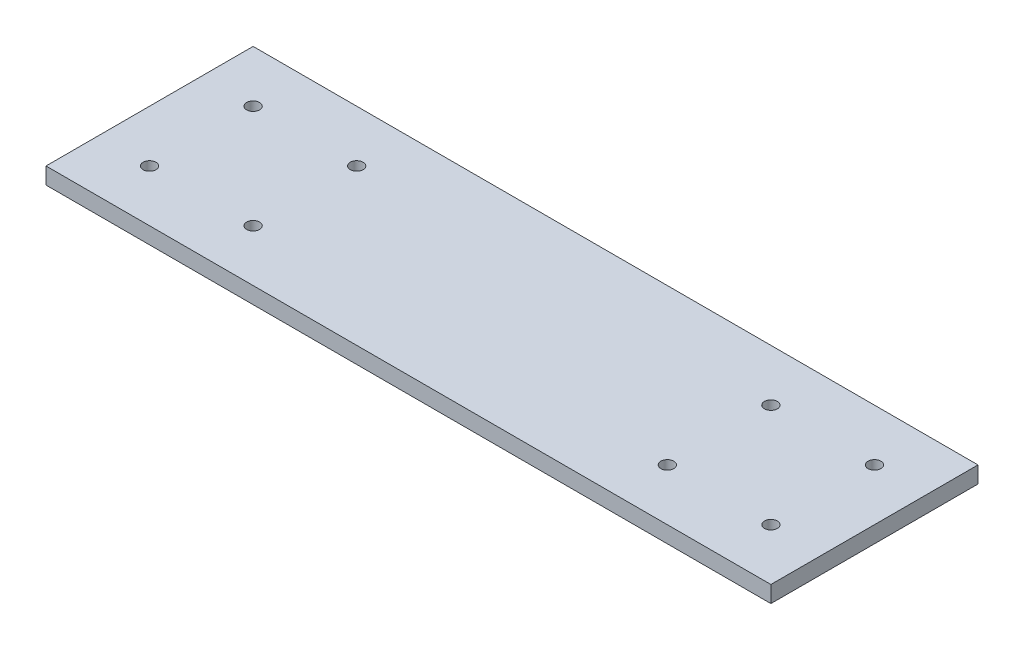
ISO-10303-21;
HEADER;
FILE_DESCRIPTION(('STEP AP214'),'2;1');
FILE_NAME('part.step','',(''),(''),'','','');
FILE_SCHEMA(('AUTOMOTIVE_DESIGN { 1 0 10303 214 1 1 1 1 }'));
ENDSEC;
DATA;
#1=APPLICATION_CONTEXT('core data for automotive mechanical design processes');
#2=APPLICATION_PROTOCOL_DEFINITION('international standard','automotive_design',2000,#1);
#3=PRODUCT_CONTEXT('',#1,'mechanical');
#4=PRODUCT('Part','Part','',(#3));
#5=PRODUCT_RELATED_PRODUCT_CATEGORY('part','',(#4));
#6=PRODUCT_DEFINITION_FORMATION('','',#4);
#7=PRODUCT_DEFINITION_CONTEXT('part definition',#1,'design');
#8=PRODUCT_DEFINITION('design','',#6,#7);
#9=PRODUCT_DEFINITION_SHAPE('','',#8);
#10=(LENGTH_UNIT() NAMED_UNIT(*) SI_UNIT(.MILLI.,.METRE.));
#11=(NAMED_UNIT(*) PLANE_ANGLE_UNIT() SI_UNIT($,.RADIAN.));
#12=(NAMED_UNIT(*) SI_UNIT($,.STERADIAN.) SOLID_ANGLE_UNIT());
#13=UNCERTAINTY_MEASURE_WITH_UNIT(LENGTH_MEASURE(1.E-05),#10,'distance_accuracy_value','');
#14=(GEOMETRIC_REPRESENTATION_CONTEXT(3) GLOBAL_UNCERTAINTY_ASSIGNED_CONTEXT((#13)) GLOBAL_UNIT_ASSIGNED_CONTEXT((#10,
#11,#12)) REPRESENTATION_CONTEXT('',''));
#15=CARTESIAN_POINT('',(0.,0.,0.));
#16=DIRECTION('',(0.,0.,1.));
#17=DIRECTION('',(1.,0.,0.));
#18=AXIS2_PLACEMENT_3D('',#15,#16,#17);
#19=CARTESIAN_POINT('',(0.,4.064,0.));
#20=DIRECTION('',(1.,0.,0.));
#21=DIRECTION('',(0.,0.,-1.));
#22=AXIS2_PLACEMENT_3D('',#19,#20,#21);
#23=PLANE('',#22);
#24=DIRECTION('',(0.,0.,1.));
#25=VECTOR('',#24,1.);
#26=CARTESIAN_POINT('',(0.,0.,0.));
#27=LINE('',#26,#25);
#28=CARTESIAN_POINT('',(0.,0.,-50.8));
#29=VERTEX_POINT('',#28);
#30=CARTESIAN_POINT('',(0.,0.,0.));
#31=VERTEX_POINT('',#30);
#32=EDGE_CURVE('E83',#29,#31,#27,.T.);
#33=ORIENTED_EDGE('',*,*,#32,.T.);
#34=DIRECTION('',(0.,-1.,0.));
#35=VECTOR('',#34,1.);
#36=CARTESIAN_POINT('',(0.,4.064,0.));
#37=LINE('',#36,#35);
#38=CARTESIAN_POINT('',(0.,4.064,0.));
#39=VERTEX_POINT('',#38);
#40=EDGE_CURVE('E11',#39,#31,#37,.T.);
#41=ORIENTED_EDGE('',*,*,#40,.F.);
#42=DIRECTION('',(0.,0.,1.));
#43=VECTOR('',#42,1.);
#44=CARTESIAN_POINT('',(0.,4.064,0.));
#45=LINE('',#44,#43);
#46=CARTESIAN_POINT('',(0.,4.064,-50.8));
#47=VERTEX_POINT('',#46);
#48=EDGE_CURVE('E77',#47,#39,#45,.T.);
#49=ORIENTED_EDGE('',*,*,#48,.F.);
#50=DIRECTION('',(0.,-1.,0.));
#51=VECTOR('',#50,1.);
#52=CARTESIAN_POINT('',(0.,4.064,-50.8));
#53=LINE('',#52,#51);
#54=EDGE_CURVE('E39',#47,#29,#53,.T.);
#55=ORIENTED_EDGE('',*,*,#54,.T.);
#56=EDGE_LOOP('',(#33,#41,#49,#55));
#57=FACE_BOUND('',#56,.T.);
#58=ADVANCED_FACE('F32',(#57),#23,.F.);
#59=CARTESIAN_POINT('',(0.,4.064,0.));
#60=DIRECTION('',(0.,0.,-1.));
#61=DIRECTION('',(-1.,0.,0.));
#62=AXIS2_PLACEMENT_3D('',#59,#60,#61);
#63=PLANE('',#62);
#64=DIRECTION('',(1.,0.,0.));
#65=VECTOR('',#64,1.);
#66=CARTESIAN_POINT('',(0.,0.,0.));
#67=LINE('',#66,#65);
#68=CARTESIAN_POINT('',(177.8,0.,0.));
#69=VERTEX_POINT('',#68);
#70=EDGE_CURVE('E78',#31,#69,#67,.T.);
#71=ORIENTED_EDGE('',*,*,#70,.T.);
#72=DIRECTION('',(0.,1.,0.));
#73=VECTOR('',#72,1.);
#74=CARTESIAN_POINT('',(177.8,0.,0.));
#75=LINE('',#74,#73);
#76=CARTESIAN_POINT('',(177.8,4.064,0.));
#77=VERTEX_POINT('',#76);
#78=EDGE_CURVE('E46',#69,#77,#75,.T.);
#79=ORIENTED_EDGE('',*,*,#78,.T.);
#80=DIRECTION('',(1.,0.,0.));
#81=VECTOR('',#80,1.);
#82=CARTESIAN_POINT('',(0.,4.064,0.));
#83=LINE('',#82,#81);
#84=EDGE_CURVE('E95',#39,#77,#83,.T.);
#85=ORIENTED_EDGE('',*,*,#84,.F.);
#86=ORIENTED_EDGE('',*,*,#40,.T.);
#87=EDGE_LOOP('',(#71,#79,#85,#86));
#88=FACE_BOUND('',#87,.T.);
#89=ADVANCED_FACE('F149',(#88),#63,.F.);
#90=CARTESIAN_POINT('',(0.,4.064,-50.8));
#91=DIRECTION('',(0.,0.,1.));
#92=DIRECTION('',(1.,0.,0.));
#93=AXIS2_PLACEMENT_3D('',#90,#91,#92);
#94=PLANE('',#93);
#95=DIRECTION('',(-1.,0.,0.));
#96=VECTOR('',#95,1.);
#97=CARTESIAN_POINT('',(0.,4.064,-50.8));
#98=LINE('',#97,#96);
#99=CARTESIAN_POINT('',(177.8,4.064,-50.8));
#100=VERTEX_POINT('',#99);
#101=EDGE_CURVE('E55',#100,#47,#98,.T.);
#102=ORIENTED_EDGE('',*,*,#101,.F.);
#103=DIRECTION('',(0.,1.,0.));
#104=VECTOR('',#103,1.);
#105=CARTESIAN_POINT('',(177.8,0.,-50.8));
#106=LINE('',#105,#104);
#107=CARTESIAN_POINT('',(177.8,0.,-50.8));
#108=VERTEX_POINT('',#107);
#109=EDGE_CURVE('E74',#108,#100,#106,.T.);
#110=ORIENTED_EDGE('',*,*,#109,.F.);
#111=DIRECTION('',(-1.,0.,0.));
#112=VECTOR('',#111,1.);
#113=CARTESIAN_POINT('',(0.,0.,-50.8));
#114=LINE('',#113,#112);
#115=EDGE_CURVE('E69',#108,#29,#114,.T.);
#116=ORIENTED_EDGE('',*,*,#115,.T.);
#117=ORIENTED_EDGE('',*,*,#54,.F.);
#118=EDGE_LOOP('',(#102,#110,#116,#117));
#119=FACE_BOUND('',#118,.T.);
#120=ADVANCED_FACE('F71',(#119),#94,.F.);
#121=CARTESIAN_POINT('',(0.,4.064,0.));
#122=DIRECTION('',(0.,-1.,0.));
#123=DIRECTION('',(0.,0.,-1.));
#124=AXIS2_PLACEMENT_3D('',#121,#122,#123);
#125=PLANE('',#124);
#126=CARTESIAN_POINT('',(12.7,4.064,-12.7));
#127=DIRECTION('',(0.,1.,0.));
#128=DIRECTION('',(0.,0.,1.));
#129=AXIS2_PLACEMENT_3D('',#126,#127,#128);
#130=CIRCLE('',#129,1.5875);
#131=CARTESIAN_POINT('',(12.7,4.064,-11.1125));
#132=VERTEX_POINT('',#131);
#133=EDGE_CURVE('E140',#132,#132,#130,.T.);
#134=ORIENTED_EDGE('',*,*,#133,.F.);
#135=EDGE_LOOP('',(#134));
#136=FACE_BOUND('',#135,.T.);
#137=CARTESIAN_POINT('',(38.1,4.064,-38.1));
#138=DIRECTION('',(0.,1.,0.));
#139=DIRECTION('',(0.,0.,1.));
#140=AXIS2_PLACEMENT_3D('',#137,#138,#139);
#141=CIRCLE('',#140,1.5875);
#142=CARTESIAN_POINT('',(38.1,4.064,-36.5125));
#143=VERTEX_POINT('',#142);
#144=EDGE_CURVE('E134',#143,#143,#141,.T.);
#145=ORIENTED_EDGE('',*,*,#144,.F.);
#146=EDGE_LOOP('',(#145));
#147=FACE_BOUND('',#146,.T.);
#148=CARTESIAN_POINT('',(12.7,4.064,-38.1));
#149=DIRECTION('',(0.,1.,0.));
#150=DIRECTION('',(0.,0.,1.));
#151=AXIS2_PLACEMENT_3D('',#148,#149,#150);
#152=CIRCLE('',#151,1.5875);
#153=CARTESIAN_POINT('',(12.7,4.064,-36.5125));
#154=VERTEX_POINT('',#153);
#155=EDGE_CURVE('E128',#154,#154,#152,.T.);
#156=ORIENTED_EDGE('',*,*,#155,.F.);
#157=EDGE_LOOP('',(#156));
#158=FACE_BOUND('',#157,.T.);
#159=CARTESIAN_POINT('',(38.1,4.064,-12.7));
#160=DIRECTION('',(0.,1.,0.));
#161=DIRECTION('',(0.,0.,1.));
#162=AXIS2_PLACEMENT_3D('',#159,#160,#161);
#163=CIRCLE('',#162,1.5875);
#164=CARTESIAN_POINT('',(38.1,4.064,-11.1125));
#165=VERTEX_POINT('',#164);
#166=EDGE_CURVE('E122',#165,#165,#163,.T.);
#167=ORIENTED_EDGE('',*,*,#166,.F.);
#168=EDGE_LOOP('',(#167));
#169=FACE_BOUND('',#168,.T.);
#170=CARTESIAN_POINT('',(139.7,4.064,-12.7));
#171=DIRECTION('',(0.,1.,0.));
#172=DIRECTION('',(0.,0.,1.));
#173=AXIS2_PLACEMENT_3D('',#170,#171,#172);
#174=CIRCLE('',#173,1.58749999999999);
#175=CARTESIAN_POINT('',(139.7,4.064,-11.1125));
#176=VERTEX_POINT('',#175);
#177=EDGE_CURVE('E116',#176,#176,#174,.T.);
#178=ORIENTED_EDGE('',*,*,#177,.F.);
#179=EDGE_LOOP('',(#178));
#180=FACE_BOUND('',#179,.T.);
#181=CARTESIAN_POINT('',(165.1,4.064,-38.1));
#182=DIRECTION('',(0.,1.,0.));
#183=DIRECTION('',(0.,0.,1.));
#184=AXIS2_PLACEMENT_3D('',#181,#182,#183);
#185=CIRCLE('',#184,1.58749999999999);
#186=CARTESIAN_POINT('',(165.1,4.064,-36.5125));
#187=VERTEX_POINT('',#186);
#188=EDGE_CURVE('E110',#187,#187,#185,.T.);
#189=ORIENTED_EDGE('',*,*,#188,.F.);
#190=EDGE_LOOP('',(#189));
#191=FACE_BOUND('',#190,.T.);
#192=CARTESIAN_POINT('',(139.7,4.064,-38.1));
#193=DIRECTION('',(0.,1.,0.));
#194=DIRECTION('',(0.,0.,1.));
#195=AXIS2_PLACEMENT_3D('',#192,#193,#194);
#196=CIRCLE('',#195,1.58749999999999);
#197=CARTESIAN_POINT('',(139.7,4.064,-36.5125));
#198=VERTEX_POINT('',#197);
#199=EDGE_CURVE('E104',#198,#198,#196,.T.);
#200=ORIENTED_EDGE('',*,*,#199,.F.);
#201=EDGE_LOOP('',(#200));
#202=FACE_BOUND('',#201,.T.);
#203=CARTESIAN_POINT('',(165.1,4.064,-12.7));
#204=DIRECTION('',(0.,1.,0.));
#205=DIRECTION('',(0.,0.,1.));
#206=AXIS2_PLACEMENT_3D('',#203,#204,#205);
#207=CIRCLE('',#206,1.58749999999999);
#208=CARTESIAN_POINT('',(165.1,4.064,-11.1125));
#209=VERTEX_POINT('',#208);
#210=EDGE_CURVE('E91',#209,#209,#207,.T.);
#211=ORIENTED_EDGE('',*,*,#210,.F.);
#212=EDGE_LOOP('',(#211));
#213=FACE_BOUND('',#212,.T.);
#214=ORIENTED_EDGE('',*,*,#84,.T.);
#215=DIRECTION('',(0.,0.,1.));
#216=VECTOR('',#215,1.);
#217=CARTESIAN_POINT('',(177.8,4.064,-50.8));
#218=LINE('',#217,#216);
#219=EDGE_CURVE('E146',#100,#77,#218,.T.);
#220=ORIENTED_EDGE('',*,*,#219,.F.);
#221=ORIENTED_EDGE('',*,*,#101,.T.);
#222=ORIENTED_EDGE('',*,*,#48,.T.);
#223=EDGE_LOOP('',(#214,#220,#221,#222));
#224=FACE_BOUND('',#223,.T.);
#225=ADVANCED_FACE('F151',(#136,#147,#158,#169,#180,#191,#202,#213,#224),#125,.F.);
#226=CARTESIAN_POINT('',(0.,0.,0.));
#227=DIRECTION('',(0.,-1.,0.));
#228=DIRECTION('',(0.,0.,-1.));
#229=AXIS2_PLACEMENT_3D('',#226,#227,#228);
#230=PLANE('',#229);
#231=DIRECTION('',(0.,0.,1.));
#232=VECTOR('',#231,1.);
#233=CARTESIAN_POINT('',(177.8,0.,-50.8));
#234=LINE('',#233,#232);
#235=EDGE_CURVE('E144',#108,#69,#234,.T.);
#236=ORIENTED_EDGE('',*,*,#235,.T.);
#237=ORIENTED_EDGE('',*,*,#70,.F.);
#238=ORIENTED_EDGE('',*,*,#32,.F.);
#239=ORIENTED_EDGE('',*,*,#115,.F.);
#240=EDGE_LOOP('',(#236,#237,#238,#239));
#241=FACE_BOUND('',#240,.T.);
#242=CARTESIAN_POINT('',(12.7,0.,-12.7));
#243=DIRECTION('',(0.,1.,0.));
#244=DIRECTION('',(0.,0.,1.));
#245=AXIS2_PLACEMENT_3D('',#242,#243,#244);
#246=CIRCLE('',#245,1.5875);
#247=CARTESIAN_POINT('',(12.7,0.,-11.1125));
#248=VERTEX_POINT('',#247);
#249=EDGE_CURVE('E137',#248,#248,#246,.T.);
#250=ORIENTED_EDGE('',*,*,#249,.T.);
#251=EDGE_LOOP('',(#250));
#252=FACE_BOUND('',#251,.T.);
#253=CARTESIAN_POINT('',(38.1,0.,-38.1));
#254=DIRECTION('',(0.,1.,0.));
#255=DIRECTION('',(0.,0.,1.));
#256=AXIS2_PLACEMENT_3D('',#253,#254,#255);
#257=CIRCLE('',#256,1.5875);
#258=CARTESIAN_POINT('',(38.1,0.,-36.5125));
#259=VERTEX_POINT('',#258);
#260=EDGE_CURVE('E131',#259,#259,#257,.T.);
#261=ORIENTED_EDGE('',*,*,#260,.T.);
#262=EDGE_LOOP('',(#261));
#263=FACE_BOUND('',#262,.T.);
#264=CARTESIAN_POINT('',(12.7,0.,-38.1));
#265=DIRECTION('',(0.,1.,0.));
#266=DIRECTION('',(0.,0.,1.));
#267=AXIS2_PLACEMENT_3D('',#264,#265,#266);
#268=CIRCLE('',#267,1.5875);
#269=CARTESIAN_POINT('',(12.7,0.,-36.5125));
#270=VERTEX_POINT('',#269);
#271=EDGE_CURVE('E125',#270,#270,#268,.T.);
#272=ORIENTED_EDGE('',*,*,#271,.T.);
#273=EDGE_LOOP('',(#272));
#274=FACE_BOUND('',#273,.T.);
#275=CARTESIAN_POINT('',(38.1,0.,-12.7));
#276=DIRECTION('',(0.,1.,0.));
#277=DIRECTION('',(0.,0.,1.));
#278=AXIS2_PLACEMENT_3D('',#275,#276,#277);
#279=CIRCLE('',#278,1.5875);
#280=CARTESIAN_POINT('',(38.1,0.,-11.1125));
#281=VERTEX_POINT('',#280);
#282=EDGE_CURVE('E119',#281,#281,#279,.T.);
#283=ORIENTED_EDGE('',*,*,#282,.T.);
#284=EDGE_LOOP('',(#283));
#285=FACE_BOUND('',#284,.T.);
#286=CARTESIAN_POINT('',(139.7,0.,-12.7));
#287=DIRECTION('',(0.,1.,0.));
#288=DIRECTION('',(0.,0.,1.));
#289=AXIS2_PLACEMENT_3D('',#286,#287,#288);
#290=CIRCLE('',#289,1.58749999999999);
#291=CARTESIAN_POINT('',(139.7,0.,-11.1125));
#292=VERTEX_POINT('',#291);
#293=EDGE_CURVE('E113',#292,#292,#290,.T.);
#294=ORIENTED_EDGE('',*,*,#293,.T.);
#295=EDGE_LOOP('',(#294));
#296=FACE_BOUND('',#295,.T.);
#297=CARTESIAN_POINT('',(165.1,0.,-38.1));
#298=DIRECTION('',(0.,1.,0.));
#299=DIRECTION('',(0.,0.,1.));
#300=AXIS2_PLACEMENT_3D('',#297,#298,#299);
#301=CIRCLE('',#300,1.58749999999999);
#302=CARTESIAN_POINT('',(165.1,0.,-36.5125));
#303=VERTEX_POINT('',#302);
#304=EDGE_CURVE('E107',#303,#303,#301,.T.);
#305=ORIENTED_EDGE('',*,*,#304,.T.);
#306=EDGE_LOOP('',(#305));
#307=FACE_BOUND('',#306,.T.);
#308=CARTESIAN_POINT('',(139.7,0.,-38.1));
#309=DIRECTION('',(0.,1.,0.));
#310=DIRECTION('',(0.,0.,1.));
#311=AXIS2_PLACEMENT_3D('',#308,#309,#310);
#312=CIRCLE('',#311,1.58749999999999);
#313=CARTESIAN_POINT('',(139.7,0.,-36.5125));
#314=VERTEX_POINT('',#313);
#315=EDGE_CURVE('E101',#314,#314,#312,.T.);
#316=ORIENTED_EDGE('',*,*,#315,.T.);
#317=EDGE_LOOP('',(#316));
#318=FACE_BOUND('',#317,.T.);
#319=CARTESIAN_POINT('',(165.1,0.,-12.7));
#320=DIRECTION('',(0.,1.,0.));
#321=DIRECTION('',(0.,0.,1.));
#322=AXIS2_PLACEMENT_3D('',#319,#320,#321);
#323=CIRCLE('',#322,1.58749999999999);
#324=CARTESIAN_POINT('',(165.1,0.,-11.1125));
#325=VERTEX_POINT('',#324);
#326=EDGE_CURVE('E87',#325,#325,#323,.T.);
#327=ORIENTED_EDGE('',*,*,#326,.T.);
#328=EDGE_LOOP('',(#327));
#329=FACE_BOUND('',#328,.T.);
#330=ADVANCED_FACE('F84',(#241,#252,#263,#274,#285,#296,#307,#318,#329),#230,.T.);
#331=CARTESIAN_POINT('',(165.1,4.064,-12.7));
#332=DIRECTION('',(0.,1.,0.));
#333=DIRECTION('',(0.,0.,1.));
#334=AXIS2_PLACEMENT_3D('',#331,#332,#333);
#335=CYLINDRICAL_SURFACE('',#334,1.58749999999999);
#336=ORIENTED_EDGE('',*,*,#326,.F.);
#337=EDGE_LOOP('',(#336));
#338=FACE_BOUND('',#337,.T.);
#339=ORIENTED_EDGE('',*,*,#210,.T.);
#340=EDGE_LOOP('',(#339));
#341=FACE_BOUND('',#340,.T.);
#342=ADVANCED_FACE('F159',(#338,#341),#335,.F.);
#343=CARTESIAN_POINT('',(139.7,4.064,-38.1));
#344=DIRECTION('',(0.,1.,0.));
#345=DIRECTION('',(0.,0.,1.));
#346=AXIS2_PLACEMENT_3D('',#343,#344,#345);
#347=CYLINDRICAL_SURFACE('',#346,1.58749999999999);
#348=ORIENTED_EDGE('',*,*,#315,.F.);
#349=EDGE_LOOP('',(#348));
#350=FACE_BOUND('',#349,.T.);
#351=ORIENTED_EDGE('',*,*,#199,.T.);
#352=EDGE_LOOP('',(#351));
#353=FACE_BOUND('',#352,.T.);
#354=ADVANCED_FACE('F245',(#350,#353),#347,.F.);
#355=CARTESIAN_POINT('',(165.1,4.064,-38.1));
#356=DIRECTION('',(0.,1.,0.));
#357=DIRECTION('',(0.,0.,1.));
#358=AXIS2_PLACEMENT_3D('',#355,#356,#357);
#359=CYLINDRICAL_SURFACE('',#358,1.58749999999999);
#360=ORIENTED_EDGE('',*,*,#304,.F.);
#361=EDGE_LOOP('',(#360));
#362=FACE_BOUND('',#361,.T.);
#363=ORIENTED_EDGE('',*,*,#188,.T.);
#364=EDGE_LOOP('',(#363));
#365=FACE_BOUND('',#364,.T.);
#366=ADVANCED_FACE('F237',(#362,#365),#359,.F.);
#367=CARTESIAN_POINT('',(139.7,4.064,-12.7));
#368=DIRECTION('',(0.,1.,0.));
#369=DIRECTION('',(0.,0.,1.));
#370=AXIS2_PLACEMENT_3D('',#367,#368,#369);
#371=CYLINDRICAL_SURFACE('',#370,1.58749999999999);
#372=ORIENTED_EDGE('',*,*,#293,.F.);
#373=EDGE_LOOP('',(#372));
#374=FACE_BOUND('',#373,.T.);
#375=ORIENTED_EDGE('',*,*,#177,.T.);
#376=EDGE_LOOP('',(#375));
#377=FACE_BOUND('',#376,.T.);
#378=ADVANCED_FACE('F229',(#374,#377),#371,.F.);
#379=CARTESIAN_POINT('',(38.1,4.064,-12.7));
#380=DIRECTION('',(0.,1.,0.));
#381=DIRECTION('',(0.,0.,1.));
#382=AXIS2_PLACEMENT_3D('',#379,#380,#381);
#383=CYLINDRICAL_SURFACE('',#382,1.5875);
#384=ORIENTED_EDGE('',*,*,#282,.F.);
#385=EDGE_LOOP('',(#384));
#386=FACE_BOUND('',#385,.T.);
#387=ORIENTED_EDGE('',*,*,#166,.T.);
#388=EDGE_LOOP('',(#387));
#389=FACE_BOUND('',#388,.T.);
#390=ADVANCED_FACE('F221',(#386,#389),#383,.F.);
#391=CARTESIAN_POINT('',(12.7,4.064,-38.1));
#392=DIRECTION('',(0.,1.,0.));
#393=DIRECTION('',(0.,0.,1.));
#394=AXIS2_PLACEMENT_3D('',#391,#392,#393);
#395=CYLINDRICAL_SURFACE('',#394,1.5875);
#396=ORIENTED_EDGE('',*,*,#271,.F.);
#397=EDGE_LOOP('',(#396));
#398=FACE_BOUND('',#397,.T.);
#399=ORIENTED_EDGE('',*,*,#155,.T.);
#400=EDGE_LOOP('',(#399));
#401=FACE_BOUND('',#400,.T.);
#402=ADVANCED_FACE('F213',(#398,#401),#395,.F.);
#403=CARTESIAN_POINT('',(38.1,4.064,-38.1));
#404=DIRECTION('',(0.,1.,0.));
#405=DIRECTION('',(0.,0.,1.));
#406=AXIS2_PLACEMENT_3D('',#403,#404,#405);
#407=CYLINDRICAL_SURFACE('',#406,1.5875);
#408=ORIENTED_EDGE('',*,*,#260,.F.);
#409=EDGE_LOOP('',(#408));
#410=FACE_BOUND('',#409,.T.);
#411=ORIENTED_EDGE('',*,*,#144,.T.);
#412=EDGE_LOOP('',(#411));
#413=FACE_BOUND('',#412,.T.);
#414=ADVANCED_FACE('F206',(#410,#413),#407,.F.);
#415=CARTESIAN_POINT('',(12.7,4.064,-12.7));
#416=DIRECTION('',(0.,1.,0.));
#417=DIRECTION('',(0.,0.,1.));
#418=AXIS2_PLACEMENT_3D('',#415,#416,#417);
#419=CYLINDRICAL_SURFACE('',#418,1.5875);
#420=ORIENTED_EDGE('',*,*,#249,.F.);
#421=EDGE_LOOP('',(#420));
#422=FACE_BOUND('',#421,.T.);
#423=ORIENTED_EDGE('',*,*,#133,.T.);
#424=EDGE_LOOP('',(#423));
#425=FACE_BOUND('',#424,.T.);
#426=ADVANCED_FACE('F197',(#422,#425),#419,.F.);
#427=CARTESIAN_POINT('',(177.8,0.,-50.8));
#428=DIRECTION('',(-1.,0.,0.));
#429=DIRECTION('',(0.,0.,1.));
#430=AXIS2_PLACEMENT_3D('',#427,#428,#429);
#431=PLANE('',#430);
#432=ORIENTED_EDGE('',*,*,#219,.T.);
#433=ORIENTED_EDGE('',*,*,#78,.F.);
#434=ORIENTED_EDGE('',*,*,#235,.F.);
#435=ORIENTED_EDGE('',*,*,#109,.T.);
#436=EDGE_LOOP('',(#432,#433,#434,#435));
#437=FACE_BOUND('',#436,.T.);
#438=ADVANCED_FACE('F193',(#437),#431,.F.);
#439=CLOSED_SHELL('',(#58,#89,#120,#225,#330,#342,#354,#366,#378,#390,#402,#414,#426,#438));
#440=MANIFOLD_SOLID_BREP('B2',#439);
#441=ADVANCED_BREP_SHAPE_REPRESENTATION('',(#18,#440),#14);
#442=SHAPE_DEFINITION_REPRESENTATION(#9,#441);
ENDSEC;
END-ISO-10303-21;
